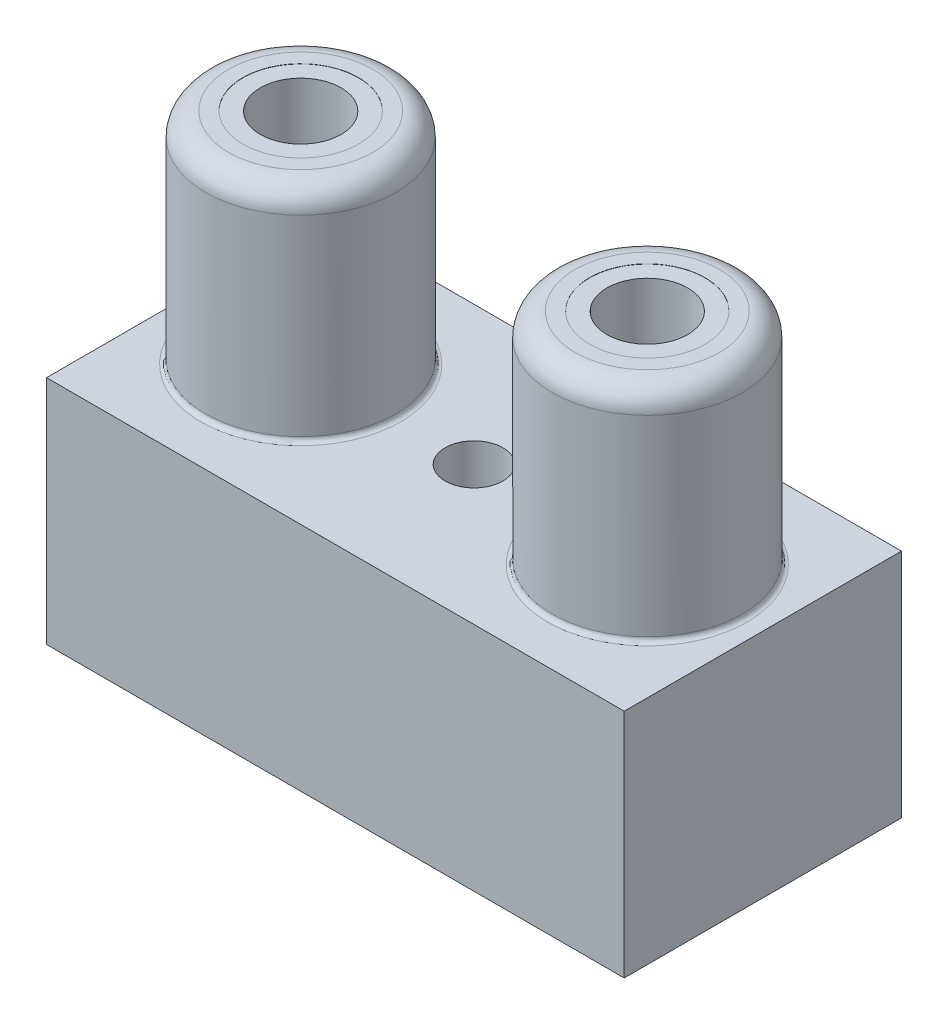
ISO-10303-21;
HEADER;
FILE_DESCRIPTION(('STEP AP214'),'2;1');
FILE_NAME('part.step','',(''),(''),'','','');
FILE_SCHEMA(('AUTOMOTIVE_DESIGN { 1 0 10303 214 1 1 1 1 }'));
ENDSEC;
DATA;
#1=APPLICATION_CONTEXT('core data for automotive mechanical design processes');
#2=APPLICATION_PROTOCOL_DEFINITION('international standard','automotive_design',2000,#1);
#3=PRODUCT_CONTEXT('',#1,'mechanical');
#4=PRODUCT('Part','Part','',(#3));
#5=PRODUCT_RELATED_PRODUCT_CATEGORY('part','',(#4));
#6=PRODUCT_DEFINITION_FORMATION('','',#4);
#7=PRODUCT_DEFINITION_CONTEXT('part definition',#1,'design');
#8=PRODUCT_DEFINITION('design','',#6,#7);
#9=PRODUCT_DEFINITION_SHAPE('','',#8);
#10=(LENGTH_UNIT() NAMED_UNIT(*) SI_UNIT(.MILLI.,.METRE.));
#11=(NAMED_UNIT(*) PLANE_ANGLE_UNIT() SI_UNIT($,.RADIAN.));
#12=(NAMED_UNIT(*) SI_UNIT($,.STERADIAN.) SOLID_ANGLE_UNIT());
#13=UNCERTAINTY_MEASURE_WITH_UNIT(LENGTH_MEASURE(1.E-05),#10,'distance_accuracy_value','');
#14=(GEOMETRIC_REPRESENTATION_CONTEXT(3) GLOBAL_UNCERTAINTY_ASSIGNED_CONTEXT((#13)) GLOBAL_UNIT_ASSIGNED_CONTEXT((#10,
#11,#12)) REPRESENTATION_CONTEXT('',''));
#15=CARTESIAN_POINT('',(0.,0.,0.));
#16=DIRECTION('',(0.,0.,1.));
#17=DIRECTION('',(1.,0.,0.));
#18=AXIS2_PLACEMENT_3D('',#15,#16,#17);
#19=CARTESIAN_POINT('',(0.,10.,0.));
#20=DIRECTION('',(0.,-1.,0.));
#21=DIRECTION('',(0.,0.,-1.));
#22=AXIS2_PLACEMENT_3D('',#19,#20,#21);
#23=PLANE('',#22);
#24=CARTESIAN_POINT('',(20.,10.,-6.));
#25=DIRECTION('',(0.,-1.,0.));
#26=DIRECTION('',(0.,0.,-1.));
#27=AXIS2_PLACEMENT_3D('',#24,#25,#26);
#28=CIRCLE('',#27,4.32);
#29=CARTESIAN_POINT('',(20.,10.,-10.32));
#30=VERTEX_POINT('',#29);
#31=EDGE_CURVE('E45',#30,#30,#28,.T.);
#32=ORIENTED_EDGE('',*,*,#31,.T.);
#33=EDGE_LOOP('',(#32));
#34=FACE_BOUND('',#33,.T.);
#35=CARTESIAN_POINT('',(5.,10.,-6.));
#36=DIRECTION('',(0.,-1.,0.));
#37=DIRECTION('',(0.,0.,-1.));
#38=AXIS2_PLACEMENT_3D('',#35,#36,#37);
#39=CIRCLE('',#38,4.32);
#40=CARTESIAN_POINT('',(5.,10.,-10.32));
#41=VERTEX_POINT('',#40);
#42=EDGE_CURVE('E128',#41,#41,#39,.T.);
#43=ORIENTED_EDGE('',*,*,#42,.T.);
#44=EDGE_LOOP('',(#43));
#45=FACE_BOUND('',#44,.T.);
#46=CARTESIAN_POINT('',(12.5,10.,-6.));
#47=DIRECTION('',(0.,1.,0.));
#48=DIRECTION('',(0.,0.,1.));
#49=AXIS2_PLACEMENT_3D('',#46,#47,#48);
#50=CIRCLE('',#49,1.25);
#51=CARTESIAN_POINT('',(12.5,10.,-4.75));
#52=VERTEX_POINT('',#51);
#53=EDGE_CURVE('E415',#52,#52,#50,.T.);
#54=ORIENTED_EDGE('',*,*,#53,.F.);
#55=EDGE_LOOP('',(#54));
#56=FACE_BOUND('',#55,.T.);
#57=DIRECTION('',(0.,0.,1.));
#58=VECTOR('',#57,1.);
#59=CARTESIAN_POINT('',(0.,10.,0.));
#60=LINE('',#59,#58);
#61=CARTESIAN_POINT('',(0.,10.,-12.));
#62=VERTEX_POINT('',#61);
#63=CARTESIAN_POINT('',(0.,10.,0.));
#64=VERTEX_POINT('',#63);
#65=EDGE_CURVE('E88',#62,#64,#60,.T.);
#66=ORIENTED_EDGE('',*,*,#65,.T.);
#67=DIRECTION('',(1.,0.,0.));
#68=VECTOR('',#67,1.);
#69=CARTESIAN_POINT('',(0.,10.,0.));
#70=LINE('',#69,#68);
#71=CARTESIAN_POINT('',(25.,10.,0.));
#72=VERTEX_POINT('',#71);
#73=EDGE_CURVE('E84',#64,#72,#70,.T.);
#74=ORIENTED_EDGE('',*,*,#73,.T.);
#75=DIRECTION('',(0.,0.,-1.));
#76=VECTOR('',#75,1.);
#77=CARTESIAN_POINT('',(25.,10.,0.));
#78=LINE('',#77,#76);
#79=CARTESIAN_POINT('',(25.,10.,-12.));
#80=VERTEX_POINT('',#79);
#81=EDGE_CURVE('E86',#72,#80,#78,.T.);
#82=ORIENTED_EDGE('',*,*,#81,.T.);
#83=DIRECTION('',(-1.,0.,0.));
#84=VECTOR('',#83,1.);
#85=CARTESIAN_POINT('',(0.,10.,-12.));
#86=LINE('',#85,#84);
#87=EDGE_CURVE('E53',#80,#62,#86,.T.);
#88=ORIENTED_EDGE('',*,*,#87,.T.);
#89=EDGE_LOOP('',(#66,#74,#82,#88));
#90=FACE_BOUND('',#89,.T.);
#91=ADVANCED_FACE('F36',(#34,#45,#56,#90),#23,.F.);
#92=CARTESIAN_POINT('',(0.,10.,0.));
#93=DIRECTION('',(1.,0.,0.));
#94=DIRECTION('',(0.,0.,-1.));
#95=AXIS2_PLACEMENT_3D('',#92,#93,#94);
#96=PLANE('',#95);
#97=DIRECTION('',(0.,0.,1.));
#98=VECTOR('',#97,1.);
#99=CARTESIAN_POINT('',(0.,0.,0.));
#100=LINE('',#99,#98);
#101=CARTESIAN_POINT('',(0.,0.,-12.));
#102=VERTEX_POINT('',#101);
#103=CARTESIAN_POINT('',(0.,0.,0.));
#104=VERTEX_POINT('',#103);
#105=EDGE_CURVE('E103',#102,#104,#100,.T.);
#106=ORIENTED_EDGE('',*,*,#105,.T.);
#107=DIRECTION('',(0.,-1.,0.));
#108=VECTOR('',#107,1.);
#109=CARTESIAN_POINT('',(0.,10.,0.));
#110=LINE('',#109,#108);
#111=EDGE_CURVE('E94',#64,#104,#110,.T.);
#112=ORIENTED_EDGE('',*,*,#111,.F.);
#113=ORIENTED_EDGE('',*,*,#65,.F.);
#114=DIRECTION('',(0.,-1.,0.));
#115=VECTOR('',#114,1.);
#116=CARTESIAN_POINT('',(0.,10.,-12.));
#117=LINE('',#116,#115);
#118=EDGE_CURVE('E99',#62,#102,#117,.T.);
#119=ORIENTED_EDGE('',*,*,#118,.T.);
#120=EDGE_LOOP('',(#106,#112,#113,#119));
#121=FACE_BOUND('',#120,.T.);
#122=ADVANCED_FACE('F192',(#121),#96,.F.);
#123=CARTESIAN_POINT('',(0.,10.,0.));
#124=DIRECTION('',(0.,0.,-1.));
#125=DIRECTION('',(-1.,0.,0.));
#126=AXIS2_PLACEMENT_3D('',#123,#124,#125);
#127=PLANE('',#126);
#128=DIRECTION('',(1.,0.,0.));
#129=VECTOR('',#128,1.);
#130=CARTESIAN_POINT('',(0.,0.,0.));
#131=LINE('',#130,#129);
#132=CARTESIAN_POINT('',(25.,0.,0.));
#133=VERTEX_POINT('',#132);
#134=EDGE_CURVE('E93',#104,#133,#131,.T.);
#135=ORIENTED_EDGE('',*,*,#134,.T.);
#136=DIRECTION('',(0.,-1.,0.));
#137=VECTOR('',#136,1.);
#138=CARTESIAN_POINT('',(25.,10.,0.));
#139=LINE('',#138,#137);
#140=EDGE_CURVE('E91',#72,#133,#139,.T.);
#141=ORIENTED_EDGE('',*,*,#140,.F.);
#142=ORIENTED_EDGE('',*,*,#73,.F.);
#143=ORIENTED_EDGE('',*,*,#111,.T.);
#144=EDGE_LOOP('',(#135,#141,#142,#143));
#145=FACE_BOUND('',#144,.T.);
#146=ADVANCED_FACE('F92',(#145),#127,.F.);
#147=CARTESIAN_POINT('',(25.,10.,0.));
#148=DIRECTION('',(-1.,0.,0.));
#149=DIRECTION('',(0.,0.,1.));
#150=AXIS2_PLACEMENT_3D('',#147,#148,#149);
#151=PLANE('',#150);
#152=DIRECTION('',(0.,0.,-1.));
#153=VECTOR('',#152,1.);
#154=CARTESIAN_POINT('',(25.,0.,0.));
#155=LINE('',#154,#153);
#156=CARTESIAN_POINT('',(25.,0.,-12.));
#157=VERTEX_POINT('',#156);
#158=EDGE_CURVE('E70',#133,#157,#155,.T.);
#159=ORIENTED_EDGE('',*,*,#158,.T.);
#160=DIRECTION('',(0.,-1.,0.));
#161=VECTOR('',#160,1.);
#162=CARTESIAN_POINT('',(25.,10.,-12.));
#163=LINE('',#162,#161);
#164=EDGE_CURVE('E95',#80,#157,#163,.T.);
#165=ORIENTED_EDGE('',*,*,#164,.F.);
#166=ORIENTED_EDGE('',*,*,#81,.F.);
#167=ORIENTED_EDGE('',*,*,#140,.T.);
#168=EDGE_LOOP('',(#159,#165,#166,#167));
#169=FACE_BOUND('',#168,.T.);
#170=ADVANCED_FACE('F97',(#169),#151,.F.);
#171=CARTESIAN_POINT('',(0.,10.,-12.));
#172=DIRECTION('',(0.,0.,1.));
#173=DIRECTION('',(1.,0.,0.));
#174=AXIS2_PLACEMENT_3D('',#171,#172,#173);
#175=PLANE('',#174);
#176=DIRECTION('',(-1.,0.,0.));
#177=VECTOR('',#176,1.);
#178=CARTESIAN_POINT('',(0.,0.,-12.));
#179=LINE('',#178,#177);
#180=EDGE_CURVE('E76',#157,#102,#179,.T.);
#181=ORIENTED_EDGE('',*,*,#180,.T.);
#182=ORIENTED_EDGE('',*,*,#118,.F.);
#183=ORIENTED_EDGE('',*,*,#87,.F.);
#184=ORIENTED_EDGE('',*,*,#164,.T.);
#185=EDGE_LOOP('',(#181,#182,#183,#184));
#186=FACE_BOUND('',#185,.T.);
#187=ADVANCED_FACE('F202',(#186),#175,.F.);
#188=CARTESIAN_POINT('',(0.,0.,0.));
#189=DIRECTION('',(0.,-1.,0.));
#190=DIRECTION('',(0.,0.,-1.));
#191=AXIS2_PLACEMENT_3D('',#188,#189,#190);
#192=PLANE('',#191);
#193=CARTESIAN_POINT('',(12.5,0.,-6.));
#194=DIRECTION('',(0.,1.,0.));
#195=DIRECTION('',(0.,0.,1.));
#196=AXIS2_PLACEMENT_3D('',#193,#194,#195);
#197=CIRCLE('',#196,1.25);
#198=CARTESIAN_POINT('',(12.5,0.,-4.75));
#199=VERTEX_POINT('',#198);
#200=EDGE_CURVE('E413',#199,#199,#197,.T.);
#201=ORIENTED_EDGE('',*,*,#200,.T.);
#202=EDGE_LOOP('',(#201));
#203=FACE_BOUND('',#202,.T.);
#204=ORIENTED_EDGE('',*,*,#105,.F.);
#205=ORIENTED_EDGE('',*,*,#180,.F.);
#206=ORIENTED_EDGE('',*,*,#158,.F.);
#207=ORIENTED_EDGE('',*,*,#134,.F.);
#208=EDGE_LOOP('',(#204,#205,#206,#207));
#209=FACE_BOUND('',#208,.T.);
#210=ADVANCED_FACE('F188',(#203,#209),#192,.T.);
#211=CARTESIAN_POINT('',(5.,19.5,-6.));
#212=DIRECTION('',(0.,-1.,0.));
#213=DIRECTION('',(0.,0.,-1.));
#214=AXIS2_PLACEMENT_3D('',#211,#212,#213);
#215=CYLINDRICAL_SURFACE('',#214,4.12);
#216=CARTESIAN_POINT('',(5.,10.2,-6.));
#217=DIRECTION('',(0.,-1.,0.));
#218=DIRECTION('',(0.,0.,-1.));
#219=AXIS2_PLACEMENT_3D('',#216,#217,#218);
#220=CIRCLE('',#219,4.12);
#221=CARTESIAN_POINT('',(5.,10.2,-10.12));
#222=VERTEX_POINT('',#221);
#223=EDGE_CURVE('E11',#222,#222,#220,.F.);
#224=ORIENTED_EDGE('',*,*,#223,.T.);
#225=EDGE_LOOP('',(#224));
#226=FACE_BOUND('',#225,.T.);
#227=CARTESIAN_POINT('',(5.,18.5,-6.));
#228=DIRECTION('',(0.,1.,0.));
#229=DIRECTION('',(0.,0.,1.));
#230=AXIS2_PLACEMENT_3D('',#227,#228,#229);
#231=CIRCLE('',#230,4.12);
#232=CARTESIAN_POINT('',(5.,18.5,-1.88));
#233=VERTEX_POINT('',#232);
#234=EDGE_CURVE('E122',#233,#233,#231,.F.);
#235=ORIENTED_EDGE('',*,*,#234,.T.);
#236=EDGE_LOOP('',(#235));
#237=FACE_BOUND('',#236,.T.);
#238=ADVANCED_FACE('F182',(#226,#237),#215,.T.);
#239=CARTESIAN_POINT('',(5.,19.5,-6.));
#240=DIRECTION('',(0.,1.,0.));
#241=DIRECTION('',(0.,0.,1.));
#242=AXIS2_PLACEMENT_3D('',#239,#240,#241);
#243=PLANE('',#242);
#244=CARTESIAN_POINT('',(5.,19.5,-6.));
#245=DIRECTION('',(0.,1.,0.));
#246=DIRECTION('',(0.,0.,1.));
#247=AXIS2_PLACEMENT_3D('',#244,#245,#246);
#248=CIRCLE('',#247,3.12);
#249=CARTESIAN_POINT('',(5.,19.5,-2.88));
#250=VERTEX_POINT('',#249);
#251=EDGE_CURVE('E119',#250,#250,#248,.T.);
#252=ORIENTED_EDGE('',*,*,#251,.T.);
#253=EDGE_LOOP('',(#252));
#254=FACE_BOUND('',#253,.T.);
#255=CARTESIAN_POINT('',(5.,19.5,-6.));
#256=DIRECTION('',(0.,1.,0.));
#257=DIRECTION('',(0.,0.,1.));
#258=AXIS2_PLACEMENT_3D('',#255,#256,#257);
#259=CIRCLE('',#258,2.5);
#260=CARTESIAN_POINT('',(5.,19.5,-3.5));
#261=VERTEX_POINT('',#260);
#262=EDGE_CURVE('E168',#261,#261,#259,.T.);
#263=ORIENTED_EDGE('',*,*,#262,.F.);
#264=EDGE_LOOP('',(#263));
#265=FACE_BOUND('',#264,.T.);
#266=ADVANCED_FACE('F145',(#254,#265),#243,.T.);
#267=CARTESIAN_POINT('',(20.,19.5,-6.));
#268=DIRECTION('',(0.,-1.,0.));
#269=DIRECTION('',(0.,0.,-1.));
#270=AXIS2_PLACEMENT_3D('',#267,#268,#269);
#271=CYLINDRICAL_SURFACE('',#270,4.12);
#272=CARTESIAN_POINT('',(20.,10.2,-6.));
#273=DIRECTION('',(0.,-1.,0.));
#274=DIRECTION('',(0.,0.,-1.));
#275=AXIS2_PLACEMENT_3D('',#272,#273,#274);
#276=CIRCLE('',#275,4.12);
#277=CARTESIAN_POINT('',(20.,10.2,-10.12));
#278=VERTEX_POINT('',#277);
#279=EDGE_CURVE('E125',#278,#278,#276,.F.);
#280=ORIENTED_EDGE('',*,*,#279,.T.);
#281=EDGE_LOOP('',(#280));
#282=FACE_BOUND('',#281,.T.);
#283=CARTESIAN_POINT('',(20.,18.5,-6.));
#284=DIRECTION('',(0.,1.,0.));
#285=DIRECTION('',(0.,0.,1.));
#286=AXIS2_PLACEMENT_3D('',#283,#284,#285);
#287=CIRCLE('',#286,4.12);
#288=CARTESIAN_POINT('',(20.,18.5,-1.88));
#289=VERTEX_POINT('',#288);
#290=EDGE_CURVE('E116',#289,#289,#287,.F.);
#291=ORIENTED_EDGE('',*,*,#290,.T.);
#292=EDGE_LOOP('',(#291));
#293=FACE_BOUND('',#292,.T.);
#294=ADVANCED_FACE('F141',(#282,#293),#271,.T.);
#295=CARTESIAN_POINT('',(20.,19.5,-6.));
#296=DIRECTION('',(0.,1.,0.));
#297=DIRECTION('',(0.,0.,1.));
#298=AXIS2_PLACEMENT_3D('',#295,#296,#297);
#299=PLANE('',#298);
#300=CARTESIAN_POINT('',(20.,19.5,-6.));
#301=DIRECTION('',(0.,1.,0.));
#302=DIRECTION('',(0.,0.,1.));
#303=AXIS2_PLACEMENT_3D('',#300,#301,#302);
#304=CIRCLE('',#303,3.12);
#305=CARTESIAN_POINT('',(20.,19.5,-2.88));
#306=VERTEX_POINT('',#305);
#307=EDGE_CURVE('E113',#306,#306,#304,.T.);
#308=ORIENTED_EDGE('',*,*,#307,.T.);
#309=EDGE_LOOP('',(#308));
#310=FACE_BOUND('',#309,.T.);
#311=CARTESIAN_POINT('',(20.,19.5,-6.));
#312=DIRECTION('',(0.,1.,0.));
#313=DIRECTION('',(0.,0.,1.));
#314=AXIS2_PLACEMENT_3D('',#311,#312,#313);
#315=CIRCLE('',#314,2.5);
#316=CARTESIAN_POINT('',(20.,19.5,-3.5));
#317=VERTEX_POINT('',#316);
#318=EDGE_CURVE('E162',#317,#317,#315,.T.);
#319=ORIENTED_EDGE('',*,*,#318,.F.);
#320=EDGE_LOOP('',(#319));
#321=FACE_BOUND('',#320,.T.);
#322=ADVANCED_FACE('F144',(#310,#321),#299,.T.);
#323=CARTESIAN_POINT('',(5.,19.49,-6.));
#324=DIRECTION('',(0.,1.,0.));
#325=DIRECTION('',(0.,0.,1.));
#326=AXIS2_PLACEMENT_3D('',#323,#324,#325);
#327=CYLINDRICAL_SURFACE('',#326,2.5);
#328=CARTESIAN_POINT('',(5.,19.49,-6.));
#329=DIRECTION('',(0.,1.,0.));
#330=DIRECTION('',(0.,0.,1.));
#331=AXIS2_PLACEMENT_3D('',#328,#329,#330);
#332=CIRCLE('',#331,2.5);
#333=CARTESIAN_POINT('',(5.,19.49,-3.5));
#334=VERTEX_POINT('',#333);
#335=EDGE_CURVE('E106',#334,#334,#332,.T.);
#336=ORIENTED_EDGE('',*,*,#335,.F.);
#337=EDGE_LOOP('',(#336));
#338=FACE_BOUND('',#337,.T.);
#339=ORIENTED_EDGE('',*,*,#262,.T.);
#340=EDGE_LOOP('',(#339));
#341=FACE_BOUND('',#340,.T.);
#342=ADVANCED_FACE('F158',(#338,#341),#327,.F.);
#343=CARTESIAN_POINT('',(5.,19.49,-6.));
#344=DIRECTION('',(0.,1.,0.));
#345=DIRECTION('',(0.,0.,1.));
#346=AXIS2_PLACEMENT_3D('',#343,#344,#345);
#347=PLANE('',#346);
#348=CARTESIAN_POINT('',(5.,19.49,-6.));
#349=DIRECTION('',(0.,1.,0.));
#350=DIRECTION('',(0.,0.,1.));
#351=AXIS2_PLACEMENT_3D('',#348,#349,#350);
#352=CIRCLE('',#351,1.75);
#353=CARTESIAN_POINT('',(5.,19.49,-4.25));
#354=VERTEX_POINT('',#353);
#355=EDGE_CURVE('E171',#354,#354,#352,.T.);
#356=ORIENTED_EDGE('',*,*,#355,.F.);
#357=EDGE_LOOP('',(#356));
#358=FACE_BOUND('',#357,.T.);
#359=ORIENTED_EDGE('',*,*,#335,.T.);
#360=EDGE_LOOP('',(#359));
#361=FACE_BOUND('',#360,.T.);
#362=ADVANCED_FACE('F307',(#358,#361),#347,.T.);
#363=CARTESIAN_POINT('',(20.,19.49,-6.));
#364=DIRECTION('',(0.,1.,0.));
#365=DIRECTION('',(0.,0.,1.));
#366=AXIS2_PLACEMENT_3D('',#363,#364,#365);
#367=CYLINDRICAL_SURFACE('',#366,2.5);
#368=CARTESIAN_POINT('',(20.,19.49,-6.));
#369=DIRECTION('',(0.,1.,0.));
#370=DIRECTION('',(0.,0.,1.));
#371=AXIS2_PLACEMENT_3D('',#368,#369,#370);
#372=CIRCLE('',#371,2.5);
#373=CARTESIAN_POINT('',(20.,19.49,-3.5));
#374=VERTEX_POINT('',#373);
#375=EDGE_CURVE('E164',#374,#374,#372,.T.);
#376=ORIENTED_EDGE('',*,*,#375,.F.);
#377=EDGE_LOOP('',(#376));
#378=FACE_BOUND('',#377,.T.);
#379=ORIENTED_EDGE('',*,*,#318,.T.);
#380=EDGE_LOOP('',(#379));
#381=FACE_BOUND('',#380,.T.);
#382=ADVANCED_FACE('F296',(#378,#381),#367,.F.);
#383=CARTESIAN_POINT('',(20.,19.49,-6.));
#384=DIRECTION('',(0.,1.,0.));
#385=DIRECTION('',(0.,0.,1.));
#386=AXIS2_PLACEMENT_3D('',#383,#384,#385);
#387=PLANE('',#386);
#388=CARTESIAN_POINT('',(20.,19.49,-6.));
#389=DIRECTION('',(0.,1.,0.));
#390=DIRECTION('',(0.,0.,1.));
#391=AXIS2_PLACEMENT_3D('',#388,#389,#390);
#392=CIRCLE('',#391,1.75);
#393=CARTESIAN_POINT('',(20.,19.49,-4.25));
#394=VERTEX_POINT('',#393);
#395=EDGE_CURVE('E409',#394,#394,#392,.T.);
#396=ORIENTED_EDGE('',*,*,#395,.F.);
#397=EDGE_LOOP('',(#396));
#398=FACE_BOUND('',#397,.T.);
#399=ORIENTED_EDGE('',*,*,#375,.T.);
#400=EDGE_LOOP('',(#399));
#401=FACE_BOUND('',#400,.T.);
#402=ADVANCED_FACE('F287',(#398,#401),#387,.T.);
#403=CARTESIAN_POINT('',(5.,4.49,-6.));
#404=DIRECTION('',(0.,1.,0.));
#405=DIRECTION('',(0.,0.,1.));
#406=AXIS2_PLACEMENT_3D('',#403,#404,#405);
#407=CYLINDRICAL_SURFACE('',#406,1.75);
#408=CARTESIAN_POINT('',(5.,4.49,-6.));
#409=DIRECTION('',(0.,1.,0.));
#410=DIRECTION('',(0.,0.,1.));
#411=AXIS2_PLACEMENT_3D('',#408,#409,#410);
#412=CIRCLE('',#411,1.75);
#413=CARTESIAN_POINT('',(5.,4.49,-4.25));
#414=VERTEX_POINT('',#413);
#415=EDGE_CURVE('E165',#414,#414,#412,.T.);
#416=ORIENTED_EDGE('',*,*,#415,.F.);
#417=EDGE_LOOP('',(#416));
#418=FACE_BOUND('',#417,.T.);
#419=ORIENTED_EDGE('',*,*,#355,.T.);
#420=EDGE_LOOP('',(#419));
#421=FACE_BOUND('',#420,.T.);
#422=ADVANCED_FACE('F278',(#418,#421),#407,.F.);
#423=CARTESIAN_POINT('',(5.,4.49,-6.));
#424=DIRECTION('',(0.,1.,0.));
#425=DIRECTION('',(0.,0.,1.));
#426=AXIS2_PLACEMENT_3D('',#423,#424,#425);
#427=PLANE('',#426);
#428=ORIENTED_EDGE('',*,*,#415,.T.);
#429=EDGE_LOOP('',(#428));
#430=FACE_BOUND('',#429,.T.);
#431=ADVANCED_FACE('F269',(#430),#427,.T.);
#432=CARTESIAN_POINT('',(20.,4.49,-6.));
#433=DIRECTION('',(0.,1.,0.));
#434=DIRECTION('',(0.,0.,1.));
#435=AXIS2_PLACEMENT_3D('',#432,#433,#434);
#436=CYLINDRICAL_SURFACE('',#435,1.75);
#437=CARTESIAN_POINT('',(20.,4.49,-6.));
#438=DIRECTION('',(0.,1.,0.));
#439=DIRECTION('',(0.,0.,1.));
#440=AXIS2_PLACEMENT_3D('',#437,#438,#439);
#441=CIRCLE('',#440,1.75);
#442=CARTESIAN_POINT('',(20.,4.49,-4.25));
#443=VERTEX_POINT('',#442);
#444=EDGE_CURVE('E407',#443,#443,#441,.T.);
#445=ORIENTED_EDGE('',*,*,#444,.F.);
#446=EDGE_LOOP('',(#445));
#447=FACE_BOUND('',#446,.T.);
#448=ORIENTED_EDGE('',*,*,#395,.T.);
#449=EDGE_LOOP('',(#448));
#450=FACE_BOUND('',#449,.T.);
#451=ADVANCED_FACE('F260',(#447,#450),#436,.F.);
#452=CARTESIAN_POINT('',(20.,4.49,-6.));
#453=DIRECTION('',(0.,1.,0.));
#454=DIRECTION('',(0.,0.,1.));
#455=AXIS2_PLACEMENT_3D('',#452,#453,#454);
#456=PLANE('',#455);
#457=ORIENTED_EDGE('',*,*,#444,.T.);
#458=EDGE_LOOP('',(#457));
#459=FACE_BOUND('',#458,.T.);
#460=ADVANCED_FACE('F250',(#459),#456,.T.);
#461=CARTESIAN_POINT('',(12.5,0.,-6.));
#462=DIRECTION('',(0.,1.,0.));
#463=DIRECTION('',(0.,0.,1.));
#464=AXIS2_PLACEMENT_3D('',#461,#462,#463);
#465=CYLINDRICAL_SURFACE('',#464,1.25);
#466=ORIENTED_EDGE('',*,*,#200,.F.);
#467=EDGE_LOOP('',(#466));
#468=FACE_BOUND('',#467,.T.);
#469=ORIENTED_EDGE('',*,*,#53,.T.);
#470=EDGE_LOOP('',(#469));
#471=FACE_BOUND('',#470,.T.);
#472=ADVANCED_FACE('F152',(#468,#471),#465,.F.);
#473=CARTESIAN_POINT('',(20.,18.5,-6.));
#474=DIRECTION('',(0.,1.,0.));
#475=DIRECTION('',(0.,0.,1.));
#476=AXIS2_PLACEMENT_3D('',#473,#474,#475);
#477=TOROIDAL_SURFACE('',#476,3.12,1.);
#478=ORIENTED_EDGE('',*,*,#290,.F.);
#479=EDGE_LOOP('',(#478));
#480=FACE_BOUND('',#479,.T.);
#481=ORIENTED_EDGE('',*,*,#307,.F.);
#482=EDGE_LOOP('',(#481));
#483=FACE_BOUND('',#482,.T.);
#484=ADVANCED_FACE('F149',(#480,#483),#477,.T.);
#485=CARTESIAN_POINT('',(5.,18.5,-6.));
#486=DIRECTION('',(0.,1.,0.));
#487=DIRECTION('',(0.,0.,1.));
#488=AXIS2_PLACEMENT_3D('',#485,#486,#487);
#489=TOROIDAL_SURFACE('',#488,3.12,1.);
#490=ORIENTED_EDGE('',*,*,#234,.F.);
#491=EDGE_LOOP('',(#490));
#492=FACE_BOUND('',#491,.T.);
#493=ORIENTED_EDGE('',*,*,#251,.F.);
#494=EDGE_LOOP('',(#493));
#495=FACE_BOUND('',#494,.T.);
#496=ADVANCED_FACE('F138',(#492,#495),#489,.T.);
#497=CARTESIAN_POINT('',(20.,10.2,-6.));
#498=DIRECTION('',(0.,-1.,0.));
#499=DIRECTION('',(0.,0.,-1.));
#500=AXIS2_PLACEMENT_3D('',#497,#498,#499);
#501=TOROIDAL_SURFACE('',#500,4.32,0.2);
#502=ORIENTED_EDGE('',*,*,#31,.F.);
#503=EDGE_LOOP('',(#502));
#504=FACE_BOUND('',#503,.T.);
#505=ORIENTED_EDGE('',*,*,#279,.F.);
#506=EDGE_LOOP('',(#505));
#507=FACE_BOUND('',#506,.T.);
#508=ADVANCED_FACE('F135',(#504,#507),#501,.F.);
#509=CARTESIAN_POINT('',(5.,10.2,-6.));
#510=DIRECTION('',(0.,-1.,0.));
#511=DIRECTION('',(0.,0.,-1.));
#512=AXIS2_PLACEMENT_3D('',#509,#510,#511);
#513=TOROIDAL_SURFACE('',#512,4.32,0.2);
#514=ORIENTED_EDGE('',*,*,#42,.F.);
#515=EDGE_LOOP('',(#514));
#516=FACE_BOUND('',#515,.T.);
#517=ORIENTED_EDGE('',*,*,#223,.F.);
#518=EDGE_LOOP('',(#517));
#519=FACE_BOUND('',#518,.T.);
#520=ADVANCED_FACE('F38',(#516,#519),#513,.F.);
#521=CLOSED_SHELL('',(#91,#122,#146,#170,#187,#210,#238,#266,#294,#322,#342,#362,#382,#402,#422,
#431,#451,#460,#472,#484,#496,#508,#520));
#522=MANIFOLD_SOLID_BREP('B2',#521);
#523=ADVANCED_BREP_SHAPE_REPRESENTATION('',(#18,#522),#14);
#524=SHAPE_DEFINITION_REPRESENTATION(#9,#523);
ENDSEC;
END-ISO-10303-21;
